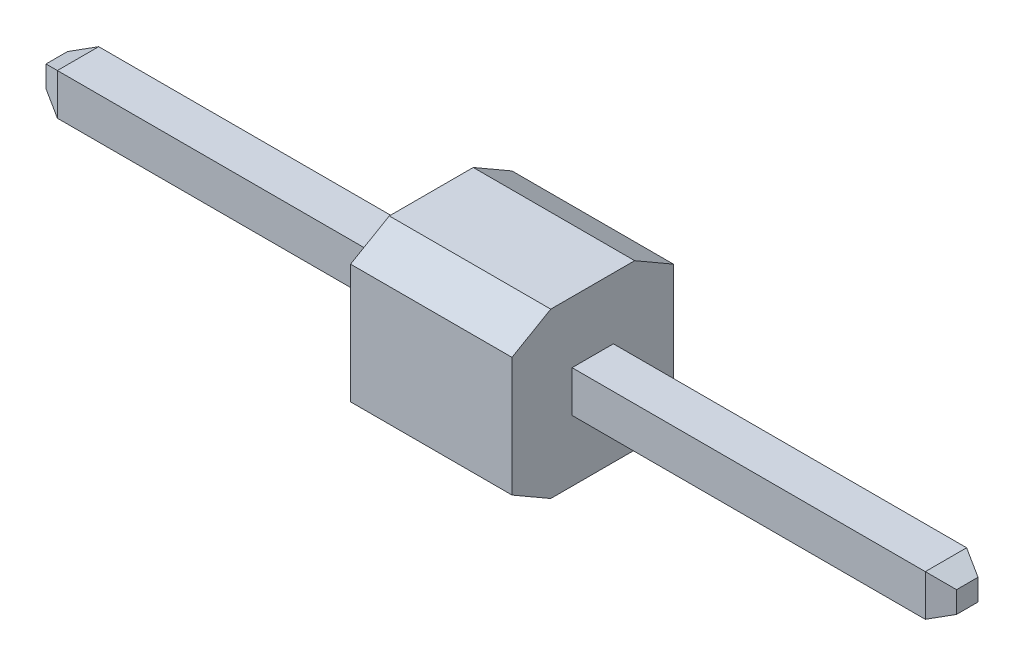
ISO-10303-21;
HEADER;
FILE_DESCRIPTION(('STEP AP214'),'2;1');
FILE_NAME('part.step','',(''),(''),'','','');
FILE_SCHEMA(('AUTOMOTIVE_DESIGN { 1 0 10303 214 1 1 1 1 }'));
ENDSEC;
DATA;
#1=APPLICATION_CONTEXT('core data for automotive mechanical design processes');
#2=APPLICATION_PROTOCOL_DEFINITION('international standard','automotive_design',2000,#1);
#3=PRODUCT_CONTEXT('',#1,'mechanical');
#4=PRODUCT('Part','Part','',(#3));
#5=PRODUCT_RELATED_PRODUCT_CATEGORY('part','',(#4));
#6=PRODUCT_DEFINITION_FORMATION('','',#4);
#7=PRODUCT_DEFINITION_CONTEXT('part definition',#1,'design');
#8=PRODUCT_DEFINITION('design','',#6,#7);
#9=PRODUCT_DEFINITION_SHAPE('','',#8);
#10=(LENGTH_UNIT() NAMED_UNIT(*) SI_UNIT(.MILLI.,.METRE.));
#11=(NAMED_UNIT(*) PLANE_ANGLE_UNIT() SI_UNIT($,.RADIAN.));
#12=(NAMED_UNIT(*) SI_UNIT($,.STERADIAN.) SOLID_ANGLE_UNIT());
#13=UNCERTAINTY_MEASURE_WITH_UNIT(LENGTH_MEASURE(1.E-05),#10,'distance_accuracy_value','');
#14=(GEOMETRIC_REPRESENTATION_CONTEXT(3) GLOBAL_UNCERTAINTY_ASSIGNED_CONTEXT((#13)) GLOBAL_UNIT_ASSIGNED_CONTEXT((#10,
#11,#12)) REPRESENTATION_CONTEXT('',''));
#15=CARTESIAN_POINT('',(0.,0.,0.));
#16=DIRECTION('',(0.,0.,1.));
#17=DIRECTION('',(1.,0.,0.));
#18=AXIS2_PLACEMENT_3D('',#15,#16,#17);
#19=CARTESIAN_POINT('',(5.42105085659442,0.317121448103038,-2.62999825440876));
#20=DIRECTION('',(1.,-9.93476518829084E-08,4.37113882867379E-08));
#21=DIRECTION('',(-9.93476589883358E-08,-1.,8.74227765734759E-08));
#22=AXIS2_PLACEMENT_3D('',#19,#20,#21);
#23=PLANE('',#22);
#24=DIRECTION('',(-1.18186632779335E-08,-0.50000007571054,-0.866025360072934));
#25=VECTOR('',#24,1.);
#26=CARTESIAN_POINT('',(5.42105066441981,-0.926468253133191,-1.05999814569068));
#27=LINE('',#26,#25);
#28=CARTESIAN_POINT('',(5.42105066441981,-0.926468253133191,-1.05999814569068));
#29=VERTEX_POINT('',#28);
#30=CARTESIAN_POINT('',(5.4210506562316,-1.27287846709686,-1.65999811540655));
#31=VERTEX_POINT('',#30);
#32=EDGE_CURVE('E11',#29,#31,#27,.T.);
#33=ORIENTED_EDGE('',*,*,#32,.T.);
#34=DIRECTION('',(4.37113811813104E-08,-8.74227828590458E-08,-0.999999999999995));
#35=VECTOR('',#34,1.);
#36=CARTESIAN_POINT('',(5.4210506562316,-1.27287846709686,-1.65999811540655));
#37=LINE('',#36,#35);
#38=CARTESIAN_POINT('',(5.4210507130564,-1.27287858074648,-2.95999811540655));
#39=VERTEX_POINT('',#38);
#40=EDGE_CURVE('E304',#31,#39,#37,.T.);
#41=ORIENTED_EDGE('',*,*,#40,.T.);
#42=DIRECTION('',(8.75289963531794E-08,0.499999924289837,-0.866025447495713));
#43=VECTOR('',#42,1.);
#44=CARTESIAN_POINT('',(5.4210507130564,-1.27287858074648,-2.95999811540655));
#45=LINE('',#44,#43);
#46=CARTESIAN_POINT('',(5.42105077369826,-0.92646847169015,-3.55999814569068));
#47=VERTEX_POINT('',#46);
#48=EDGE_CURVE('E296',#39,#47,#45,.T.);
#49=ORIENTED_EDGE('',*,*,#48,.T.);
#50=DIRECTION('',(9.93476588436478E-08,0.999999999999991,-8.74227767226935E-08));
#51=VECTOR('',#50,1.);
#52=CARTESIAN_POINT('',(5.42105077369826,-0.92646847169015,-3.55999814569068));
#53=LINE('',#52,#51);
#54=CARTESIAN_POINT('',(5.42105095721124,0.920711205279851,-3.55999830717626));
#55=VERTEX_POINT('',#54);
#56=EDGE_CURVE('E281',#47,#55,#53,.T.);
#57=ORIENTED_EDGE('',*,*,#56,.T.);
#58=DIRECTION('',(-1.18186632778483E-08,-0.500000075710537,-0.866025360072935));
#59=VECTOR('',#58,1.);
#60=CARTESIAN_POINT('',(5.42105096539945,1.26712141925352,-2.9599983374604));
#61=LINE('',#60,#59);
#62=CARTESIAN_POINT('',(5.42105096539945,1.26712141925352,-2.9599983374604));
#63=VERTEX_POINT('',#62);
#64=EDGE_CURVE('E265',#63,#55,#61,.T.);
#65=ORIENTED_EDGE('',*,*,#64,.F.);
#66=DIRECTION('',(4.37113811813104E-08,-8.74227828590458E-08,-0.999999999999995));
#67=VECTOR('',#66,1.);
#68=CARTESIAN_POINT('',(5.42105090857466,1.26712153290314,-1.6599983374604));
#69=LINE('',#68,#67);
#70=CARTESIAN_POINT('',(5.42105090857466,1.26712153290314,-1.6599983374604));
#71=VERTEX_POINT('',#70);
#72=EDGE_CURVE('E248',#71,#63,#69,.T.);
#73=ORIENTED_EDGE('',*,*,#72,.F.);
#74=DIRECTION('',(8.75289963525479E-08,0.499999924289836,-0.866025447495713));
#75=VECTOR('',#74,1.);
#76=CARTESIAN_POINT('',(5.42105084793279,0.92071142383681,-1.05999830717626));
#77=LINE('',#76,#75);
#78=CARTESIAN_POINT('',(5.42105084793279,0.92071142383681,-1.05999830717626));
#79=VERTEX_POINT('',#78);
#80=EDGE_CURVE('E242',#79,#71,#77,.T.);
#81=ORIENTED_EDGE('',*,*,#80,.F.);
#82=DIRECTION('',(9.93476588436478E-08,0.999999999999991,-8.7422776241864E-08));
#83=VECTOR('',#82,1.);
#84=CARTESIAN_POINT('',(5.42105066441981,-0.926468253133191,-1.05999814569068));
#85=LINE('',#84,#83);
#86=EDGE_CURVE('E236',#29,#79,#85,.T.);
#87=ORIENTED_EDGE('',*,*,#86,.F.);
#88=EDGE_LOOP('',(#33,#41,#49,#57,#65,#73,#81,#87));
#89=FACE_BOUND('',#88,.T.);
#90=DIRECTION('',(-4.37113803486431E-08,8.74227829017466E-08,0.999999999999995));
#91=VECTOR('',#90,1.);
#92=CARTESIAN_POINT('',(5.42105079301192,-0.322878551896961,-2.62999819845818));
#93=LINE('',#92,#91);
#94=CARTESIAN_POINT('',(5.42105079301192,-0.322878551896961,-2.62999819845818));
#95=VERTEX_POINT('',#94);
#96=CARTESIAN_POINT('',(5.42105076503663,-0.32287849594638,-1.98999819845818));
#97=VERTEX_POINT('',#96);
#98=EDGE_CURVE('E302',#95,#97,#93,.T.);
#99=ORIENTED_EDGE('',*,*,#98,.T.);
#100=DIRECTION('',(-9.93476578781121E-08,-0.999999999999991,8.7422776656742E-08));
#101=VECTOR('',#100,1.);
#102=CARTESIAN_POINT('',(5.42105082861914,0.317121504053619,-1.98999825440876));
#103=LINE('',#102,#101);
#104=CARTESIAN_POINT('',(5.42105082861914,0.317121504053619,-1.98999825440876));
#105=VERTEX_POINT('',#104);
#106=EDGE_CURVE('E293',#105,#97,#103,.T.);
#107=ORIENTED_EDGE('',*,*,#106,.F.);
#108=DIRECTION('',(-4.37113817364219E-08,8.74227829017467E-08,0.999999999999995));
#109=VECTOR('',#108,1.);
#110=CARTESIAN_POINT('',(5.42105085659442,0.317121448103038,-2.62999825440876));
#111=LINE('',#110,#109);
#112=CARTESIAN_POINT('',(5.42105085659442,0.317121448103038,-2.62999825440876));
#113=VERTEX_POINT('',#112);
#114=EDGE_CURVE('E278',#113,#105,#111,.T.);
#115=ORIENTED_EDGE('',*,*,#114,.F.);
#116=DIRECTION('',(-9.93476592658908E-08,-0.999999999999991,8.74227759628526E-08));
#117=VECTOR('',#116,1.);
#118=CARTESIAN_POINT('',(5.42105085659442,0.317121448103038,-2.62999825440876));
#119=LINE('',#118,#117);
#120=EDGE_CURVE('E263',#113,#95,#119,.T.);
#121=ORIENTED_EDGE('',*,*,#120,.T.);
#122=EDGE_LOOP('',(#99,#107,#115,#121));
#123=FACE_BOUND('',#122,.T.);
#124=ADVANCED_FACE('F17',(#89,#123),#23,.T.);
#125=CARTESIAN_POINT('',(2.92105085659442,0.317121696472167,-2.62999836368723));
#126=DIRECTION('',(1.,-9.93476518829084E-08,4.37113882867379E-08));
#127=DIRECTION('',(-9.93476589883358E-08,-1.,8.74227765734759E-08));
#128=AXIS2_PLACEMENT_3D('',#125,#126,#127);
#129=PLANE('',#128);
#130=DIRECTION('',(-1.1818662636946E-08,-0.50000007571054,-0.866025360072934));
#131=VECTOR('',#130,1.);
#132=CARTESIAN_POINT('',(2.92105066441981,-0.926468004764061,-1.05999825496915));
#133=LINE('',#132,#131);
#134=CARTESIAN_POINT('',(2.92105066441981,-0.926468004764061,-1.05999825496915));
#135=VERTEX_POINT('',#134);
#136=CARTESIAN_POINT('',(2.9210506562316,-1.27287821872773,-1.65999822468502));
#137=VERTEX_POINT('',#136);
#138=EDGE_CURVE('E24',#135,#137,#133,.T.);
#139=ORIENTED_EDGE('',*,*,#138,.F.);
#140=DIRECTION('',(9.93476590840625E-08,0.999999999999991,-8.7422776241864E-08));
#141=VECTOR('',#140,1.);
#142=CARTESIAN_POINT('',(2.92105066441981,-0.926468004764061,-1.05999825496915));
#143=LINE('',#142,#141);
#144=CARTESIAN_POINT('',(2.92105084793279,0.92071167220594,-1.05999841645473));
#145=VERTEX_POINT('',#144);
#146=EDGE_CURVE('E300',#135,#145,#143,.T.);
#147=ORIENTED_EDGE('',*,*,#146,.T.);
#148=DIRECTION('',(8.75289957115603E-08,0.499999924289836,-0.866025447495713));
#149=VECTOR('',#148,1.);
#150=CARTESIAN_POINT('',(2.92105084793279,0.92071167220594,-1.05999841645473));
#151=LINE('',#150,#149);
#152=CARTESIAN_POINT('',(2.92105090857466,1.26712178127227,-1.65999844673887));
#153=VERTEX_POINT('',#152);
#154=EDGE_CURVE('E286',#145,#153,#151,.T.);
#155=ORIENTED_EDGE('',*,*,#154,.T.);
#156=DIRECTION('',(4.37113811813104E-08,-8.74227828590458E-08,-0.999999999999995));
#157=VECTOR('',#156,1.);
#158=CARTESIAN_POINT('',(2.92105090857466,1.26712178127227,-1.65999844673887));
#159=LINE('',#158,#157);
#160=CARTESIAN_POINT('',(2.92105096539945,1.26712166762265,-2.95999844673887));
#161=VERTEX_POINT('',#160);
#162=EDGE_CURVE('E271',#153,#161,#159,.T.);
#163=ORIENTED_EDGE('',*,*,#162,.T.);
#164=DIRECTION('',(-1.18186626368607E-08,-0.500000075710537,-0.866025360072935));
#165=VECTOR('',#164,1.);
#166=CARTESIAN_POINT('',(2.92105096539945,1.26712166762265,-2.95999844673887));
#167=LINE('',#166,#165);
#168=CARTESIAN_POINT('',(2.92105095721124,0.92071145364898,-3.55999841645473));
#169=VERTEX_POINT('',#168);
#170=EDGE_CURVE('E253',#161,#169,#167,.T.);
#171=ORIENTED_EDGE('',*,*,#170,.T.);
#172=DIRECTION('',(9.93476590840625E-08,0.999999999999991,-8.74227767226935E-08));
#173=VECTOR('',#172,1.);
#174=CARTESIAN_POINT('',(2.92105077369826,-0.92646822332102,-3.55999825496915));
#175=LINE('',#174,#173);
#176=CARTESIAN_POINT('',(2.92105077369826,-0.92646822332102,-3.55999825496915));
#177=VERTEX_POINT('',#176);
#178=EDGE_CURVE('E261',#177,#169,#175,.T.);
#179=ORIENTED_EDGE('',*,*,#178,.F.);
#180=DIRECTION('',(8.75289957121919E-08,0.499999924289837,-0.866025447495713));
#181=VECTOR('',#180,1.);
#182=CARTESIAN_POINT('',(2.9210507130564,-1.27287833237735,-2.95999822468502));
#183=LINE('',#182,#181);
#184=CARTESIAN_POINT('',(2.9210507130564,-1.27287833237735,-2.95999822468502));
#185=VERTEX_POINT('',#184);
#186=EDGE_CURVE('E276',#185,#177,#183,.T.);
#187=ORIENTED_EDGE('',*,*,#186,.F.);
#188=DIRECTION('',(4.37113811813104E-08,-8.74227828590458E-08,-0.999999999999995));
#189=VECTOR('',#188,1.);
#190=CARTESIAN_POINT('',(2.9210506562316,-1.27287821872773,-1.65999822468502));
#191=LINE('',#190,#189);
#192=EDGE_CURVE('E291',#137,#185,#191,.T.);
#193=ORIENTED_EDGE('',*,*,#192,.F.);
#194=EDGE_LOOP('',(#139,#147,#155,#163,#171,#179,#187,#193));
#195=FACE_BOUND('',#194,.T.);
#196=DIRECTION('',(-9.93476592658908E-08,-0.999999999999991,8.7422776656742E-08));
#197=VECTOR('',#196,1.);
#198=CARTESIAN_POINT('',(2.92105082861914,0.317121752422748,-1.98999836368723));
#199=LINE('',#198,#197);
#200=CARTESIAN_POINT('',(2.92105082861914,0.317121752422748,-1.98999836368723));
#201=VERTEX_POINT('',#200);
#202=CARTESIAN_POINT('',(2.92105076503663,-0.32287824757725,-1.98999830773665));
#203=VERTEX_POINT('',#202);
#204=EDGE_CURVE('E298',#201,#203,#199,.T.);
#205=ORIENTED_EDGE('',*,*,#204,.T.);
#206=DIRECTION('',(-4.37113810425325E-08,8.74227829017466E-08,0.999999999999995));
#207=VECTOR('',#206,1.);
#208=CARTESIAN_POINT('',(2.92105079301192,-0.322878303527832,-2.62999830773665));
#209=LINE('',#208,#207);
#210=CARTESIAN_POINT('',(2.92105079301192,-0.322878303527832,-2.62999830773665));
#211=VERTEX_POINT('',#210);
#212=EDGE_CURVE('E283',#211,#203,#209,.T.);
#213=ORIENTED_EDGE('',*,*,#212,.F.);
#214=DIRECTION('',(-9.93476592658908E-08,-0.999999999999991,8.74227759628526E-08));
#215=VECTOR('',#214,1.);
#216=CARTESIAN_POINT('',(2.92105085659442,0.317121696472167,-2.62999836368723));
#217=LINE('',#216,#215);
#218=CARTESIAN_POINT('',(2.92105085659442,0.317121696472167,-2.62999836368723));
#219=VERTEX_POINT('',#218);
#220=EDGE_CURVE('E268',#219,#211,#217,.T.);
#221=ORIENTED_EDGE('',*,*,#220,.F.);
#222=DIRECTION('',(-4.37113810425325E-08,8.74227829017467E-08,0.999999999999995));
#223=VECTOR('',#222,1.);
#224=CARTESIAN_POINT('',(2.92105085659442,0.317121696472167,-2.62999836368723));
#225=LINE('',#224,#223);
#226=EDGE_CURVE('E251',#219,#201,#225,.T.);
#227=ORIENTED_EDGE('',*,*,#226,.T.);
#228=EDGE_LOOP('',(#205,#213,#221,#227));
#229=FACE_BOUND('',#228,.T.);
#230=ADVANCED_FACE('F314',(#195,#229),#129,.F.);
#231=CARTESIAN_POINT('',(5.42105066441981,-0.926468253133191,-1.05999814569068));
#232=DIRECTION('',(1.07893287081065E-07,0.866025360072937,-0.500000075710535));
#233=DIRECTION('',(1.18186629566715E-08,0.500000075710542,0.866025360072941));
#234=AXIS2_PLACEMENT_3D('',#231,#232,#233);
#235=PLANE('',#234);
#236=ORIENTED_EDGE('',*,*,#138,.T.);
#237=DIRECTION('',(-0.999999999999994,9.93476518829078E-08,-4.37113883755555E-08));
#238=VECTOR('',#237,1.);
#239=CARTESIAN_POINT('',(5.4210506562316,-1.27287846709686,-1.65999811540655));
#240=LINE('',#239,#238);
#241=EDGE_CURVE('E288',#31,#137,#240,.T.);
#242=ORIENTED_EDGE('',*,*,#241,.F.);
#243=ORIENTED_EDGE('',*,*,#32,.F.);
#244=DIRECTION('',(-0.999999999999994,9.93476518829078E-08,-4.3711388109102E-08));
#245=VECTOR('',#244,1.);
#246=CARTESIAN_POINT('',(5.42105066441981,-0.926468253133191,-1.05999814569068));
#247=LINE('',#246,#245);
#248=EDGE_CURVE('E256',#29,#135,#247,.T.);
#249=ORIENTED_EDGE('',*,*,#248,.T.);
#250=EDGE_LOOP('',(#236,#242,#243,#249));
#251=FACE_BOUND('',#250,.T.);
#252=ADVANCED_FACE('F306',(#251),#235,.F.);
#253=CARTESIAN_POINT('',(5.4210506562316,-1.27287846709686,-1.65999811540655));
#254=DIRECTION('',(9.93476589883358E-08,1.,-8.74227765734759E-08));
#255=DIRECTION('',(1.,-9.93476518829084E-08,4.37113882867379E-08));
#256=AXIS2_PLACEMENT_3D('',#253,#254,#255);
#257=PLANE('',#256);
#258=ORIENTED_EDGE('',*,*,#192,.T.);
#259=DIRECTION('',(-0.999999999999994,9.93476518829078E-08,-4.37113882867377E-08));
#260=VECTOR('',#259,1.);
#261=CARTESIAN_POINT('',(5.4210507130564,-1.27287858074648,-2.95999811540655));
#262=LINE('',#261,#260);
#263=EDGE_CURVE('E273',#39,#185,#262,.T.);
#264=ORIENTED_EDGE('',*,*,#263,.F.);
#265=ORIENTED_EDGE('',*,*,#40,.F.);
#266=ORIENTED_EDGE('',*,*,#241,.T.);
#267=EDGE_LOOP('',(#258,#264,#265,#266));
#268=FACE_BOUND('',#267,.T.);
#269=ADVANCED_FACE('F311',(#268),#257,.F.);
#270=CARTESIAN_POINT('',(5.4210507130564,-1.27287858074648,-2.95999811540655));
#271=DIRECTION('',(6.41819058997377E-08,0.866025447495721,0.499999924289845));
#272=DIRECTION('',(-8.7528996031702E-08,-0.499999924289838,0.866025447495717));
#273=AXIS2_PLACEMENT_3D('',#270,#271,#272);
#274=PLANE('',#273);
#275=ORIENTED_EDGE('',*,*,#186,.T.);
#276=DIRECTION('',(-0.999999999999994,9.93476518829078E-08,-4.37113884643734E-08));
#277=VECTOR('',#276,1.);
#278=CARTESIAN_POINT('',(5.42105077369826,-0.92646847169015,-3.55999814569068));
#279=LINE('',#278,#277);
#280=EDGE_CURVE('E258',#47,#177,#279,.T.);
#281=ORIENTED_EDGE('',*,*,#280,.F.);
#282=ORIENTED_EDGE('',*,*,#48,.F.);
#283=ORIENTED_EDGE('',*,*,#263,.T.);
#284=EDGE_LOOP('',(#275,#281,#282,#283));
#285=FACE_BOUND('',#284,.T.);
#286=ADVANCED_FACE('F319',(#285),#274,.F.);
#287=CARTESIAN_POINT('',(5.42105077369826,-0.92646847169015,-3.55999814569068));
#288=DIRECTION('',(-4.37113811813106E-08,8.74227836789032E-08,1.));
#289=DIRECTION('',(-1.,9.93476518829084E-08,-4.37113882867379E-08));
#290=AXIS2_PLACEMENT_3D('',#287,#288,#289);
#291=PLANE('',#290);
#292=ORIENTED_EDGE('',*,*,#178,.T.);
#293=DIRECTION('',(-0.999999999999994,9.93476533039933E-08,-4.37113882867377E-08));
#294=VECTOR('',#293,1.);
#295=CARTESIAN_POINT('',(5.42105095721124,0.920711205279851,-3.55999830717626));
#296=LINE('',#295,#294);
#297=EDGE_CURVE('E245',#55,#169,#296,.T.);
#298=ORIENTED_EDGE('',*,*,#297,.F.);
#299=ORIENTED_EDGE('',*,*,#56,.F.);
#300=ORIENTED_EDGE('',*,*,#280,.T.);
#301=EDGE_LOOP('',(#292,#298,#299,#300));
#302=FACE_BOUND('',#301,.T.);
#303=ADVANCED_FACE('F326',(#302),#291,.F.);
#304=CARTESIAN_POINT('',(5.42105096539945,1.26712141925352,-2.9599983374604));
#305=DIRECTION('',(1.07893287081065E-07,0.866025360072937,-0.500000075710535));
#306=DIRECTION('',(1.18186629566715E-08,0.500000075710542,0.866025360072941));
#307=AXIS2_PLACEMENT_3D('',#304,#305,#306);
#308=PLANE('',#307);
#309=ORIENTED_EDGE('',*,*,#170,.F.);
#310=DIRECTION('',(-0.999999999999994,9.93476511723651E-08,-4.37113882867377E-08));
#311=VECTOR('',#310,1.);
#312=CARTESIAN_POINT('',(5.42105096539945,1.26712141925352,-2.9599983374604));
#313=LINE('',#312,#311);
#314=EDGE_CURVE('E239',#63,#161,#313,.T.);
#315=ORIENTED_EDGE('',*,*,#314,.F.);
#316=ORIENTED_EDGE('',*,*,#64,.T.);
#317=ORIENTED_EDGE('',*,*,#297,.T.);
#318=EDGE_LOOP('',(#309,#315,#316,#317));
#319=FACE_BOUND('',#318,.T.);
#320=ADVANCED_FACE('F329',(#319),#308,.T.);
#321=CARTESIAN_POINT('',(5.42105090857466,1.26712153290314,-1.6599983374604));
#322=DIRECTION('',(9.93476589883358E-08,1.,-8.74227765734759E-08));
#323=DIRECTION('',(1.,-9.93476518829084E-08,4.37113882867379E-08));
#324=AXIS2_PLACEMENT_3D('',#321,#322,#323);
#325=PLANE('',#324);
#326=ORIENTED_EDGE('',*,*,#162,.F.);
#327=DIRECTION('',(-0.999999999999994,9.93476511723651E-08,-4.37113884643734E-08));
#328=VECTOR('',#327,1.);
#329=CARTESIAN_POINT('',(5.42105090857466,1.26712153290314,-1.6599983374604));
#330=LINE('',#329,#328);
#331=EDGE_CURVE('E233',#71,#153,#330,.T.);
#332=ORIENTED_EDGE('',*,*,#331,.F.);
#333=ORIENTED_EDGE('',*,*,#72,.T.);
#334=ORIENTED_EDGE('',*,*,#314,.T.);
#335=EDGE_LOOP('',(#326,#332,#333,#334));
#336=FACE_BOUND('',#335,.T.);
#337=ADVANCED_FACE('F333',(#336),#325,.T.);
#338=CARTESIAN_POINT('',(5.42105084793279,0.92071142383681,-1.05999830717626));
#339=DIRECTION('',(6.41819058997377E-08,0.866025447495721,0.499999924289845));
#340=DIRECTION('',(-8.7528996031702E-08,-0.499999924289838,0.866025447495717));
#341=AXIS2_PLACEMENT_3D('',#338,#339,#340);
#342=PLANE('',#341);
#343=ORIENTED_EDGE('',*,*,#154,.F.);
#344=DIRECTION('',(-0.999999999999994,9.93476533039933E-08,-4.3711388109102E-08));
#345=VECTOR('',#344,1.);
#346=CARTESIAN_POINT('',(5.42105084793279,0.92071142383681,-1.05999830717626));
#347=LINE('',#346,#345);
#348=EDGE_CURVE('E230',#79,#145,#347,.T.);
#349=ORIENTED_EDGE('',*,*,#348,.F.);
#350=ORIENTED_EDGE('',*,*,#80,.T.);
#351=ORIENTED_EDGE('',*,*,#331,.T.);
#352=EDGE_LOOP('',(#343,#349,#350,#351));
#353=FACE_BOUND('',#352,.T.);
#354=ADVANCED_FACE('F337',(#353),#342,.T.);
#355=CARTESIAN_POINT('',(5.42105066441981,-0.926468253133191,-1.05999814569068));
#356=DIRECTION('',(-4.37113811813106E-08,8.74227835615132E-08,1.));
#357=DIRECTION('',(-9.93476589883358E-08,-1.,8.74227764560859E-08));
#358=AXIS2_PLACEMENT_3D('',#355,#356,#357);
#359=PLANE('',#358);
#360=ORIENTED_EDGE('',*,*,#146,.F.);
#361=ORIENTED_EDGE('',*,*,#248,.F.);
#362=ORIENTED_EDGE('',*,*,#86,.T.);
#363=ORIENTED_EDGE('',*,*,#348,.T.);
#364=EDGE_LOOP('',(#360,#361,#362,#363));
#365=FACE_BOUND('',#364,.T.);
#366=ADVANCED_FACE('F339',(#365),#359,.T.);
#367=CARTESIAN_POINT('',(-2.87894914340558,0.317122272688549,-2.62999861721328));
#368=DIRECTION('',(-1.,9.93476518829084E-08,-4.37113882867379E-08));
#369=DIRECTION('',(9.93476589883358E-08,1.,-8.74227765734759E-08));
#370=AXIS2_PLACEMENT_3D('',#367,#368,#369);
#371=PLANE('',#370);
#372=DIRECTION('',(9.93476608211201E-08,0.999999999999991,-8.7422776141512E-08));
#373=VECTOR('',#372,1.);
#374=CARTESIAN_POINT('',(-2.87894921294922,-0.168996157623621,-2.14388010190646));
#375=LINE('',#374,#373);
#376=CARTESIAN_POINT('',(-2.87894921294922,-0.168996157623621,-2.14388010190646));
#377=VERTEX_POINT('',#376);
#378=CARTESIAN_POINT('',(-2.87894917994226,0.163240787986378,-2.14388013095153));
#379=VERTEX_POINT('',#378);
#380=EDGE_CURVE('E228',#377,#379,#375,.T.);
#381=ORIENTED_EDGE('',*,*,#380,.T.);
#382=DIRECTION('',(4.37113820547149E-08,-8.74227801493995E-08,-0.999999999999995));
#383=VECTOR('',#382,1.);
#384=CARTESIAN_POINT('',(-2.87894917994226,0.163240787986378,-2.14388013095153));
#385=LINE('',#384,#383);
#386=CARTESIAN_POINT('',(-2.87894916541972,0.163240758941301,-2.47611707656953));
#387=VERTEX_POINT('',#386);
#388=EDGE_CURVE('E223',#379,#387,#385,.T.);
#389=ORIENTED_EDGE('',*,*,#388,.T.);
#390=DIRECTION('',(-9.93476581477913E-08,-0.999999999999991,8.74227761415115E-08));
#391=VECTOR('',#390,1.);
#392=CARTESIAN_POINT('',(-2.87894916541972,0.163240758941303,-2.47611707656953));
#393=LINE('',#392,#391);
#394=CARTESIAN_POINT('',(-2.87894919842669,-0.168996186668698,-2.47611704752446));
#395=VERTEX_POINT('',#394);
#396=EDGE_CURVE('E215',#387,#395,#393,.T.);
#397=ORIENTED_EDGE('',*,*,#396,.T.);
#398=DIRECTION('',(-4.37113740347301E-08,8.7422774802743E-08,0.999999999999995));
#399=VECTOR('',#398,1.);
#400=CARTESIAN_POINT('',(-2.87894919842669,-0.168996186668698,-2.47611704752446));
#401=LINE('',#400,#399);
#402=EDGE_CURVE('E207',#395,#377,#401,.T.);
#403=ORIENTED_EDGE('',*,*,#402,.T.);
#404=EDGE_LOOP('',(#381,#389,#397,#403));
#405=FACE_BOUND('',#404,.T.);
#406=ADVANCED_FACE('F341',(#405),#371,.T.);
#407=CARTESIAN_POINT('',(-2.87894914340558,0.317122272688549,-2.62999861721328));
#408=DIRECTION('',(9.93476589883358E-08,1.,-8.74227764510112E-08));
#409=DIRECTION('',(-4.37113811813106E-08,8.74227835564385E-08,1.));
#410=AXIS2_PLACEMENT_3D('',#407,#408,#409);
#411=PLANE('',#410);
#412=DIRECTION('',(0.999999999999994,-9.93476511294987E-08,4.37113883581816E-08));
#413=VECTOR('',#412,1.);
#414=CARTESIAN_POINT('',(-2.54894914340558,0.317122239903822,-2.62999860278853));
#415=LINE('',#414,#413);
#416=CARTESIAN_POINT('',(-2.54894914340558,0.317122239903822,-2.62999860278853));
#417=VERTEX_POINT('',#416);
#418=EDGE_CURVE('E225',#417,#219,#415,.T.);
#419=ORIENTED_EDGE('',*,*,#418,.F.);
#420=DIRECTION('',(-4.37113817364219E-08,8.74227829017466E-08,0.999999999999995));
#421=VECTOR('',#420,1.);
#422=CARTESIAN_POINT('',(-2.54894914340558,0.317122239903822,-2.62999860278853));
#423=LINE('',#422,#421);
#424=CARTESIAN_POINT('',(-2.54894917138086,0.317122295854404,-1.98999860278853));
#425=VERTEX_POINT('',#424);
#426=EDGE_CURVE('E217',#417,#425,#423,.T.);
#427=ORIENTED_EDGE('',*,*,#426,.T.);
#428=DIRECTION('',(0.999999999999994,-9.93476511294987E-08,4.37113882364021E-08));
#429=VECTOR('',#428,1.);
#430=CARTESIAN_POINT('',(-2.54894917138086,0.317122295854404,-1.98999860278853));
#431=LINE('',#430,#429);
#432=EDGE_CURVE('E220',#425,#201,#431,.T.);
#433=ORIENTED_EDGE('',*,*,#432,.T.);
#434=ORIENTED_EDGE('',*,*,#226,.F.);
#435=EDGE_LOOP('',(#419,#427,#433,#434));
#436=FACE_BOUND('',#435,.T.);
#437=ADVANCED_FACE('F348',(#436),#411,.T.);
#438=CARTESIAN_POINT('',(-2.87894917138086,0.31712232863913,-1.98999861721328));
#439=DIRECTION('',(-4.37113811813106E-08,8.74227836789032E-08,1.));
#440=DIRECTION('',(-1.,9.93476518829084E-08,-4.37113882867379E-08));
#441=AXIS2_PLACEMENT_3D('',#438,#439,#440);
#442=PLANE('',#441);
#443=ORIENTED_EDGE('',*,*,#432,.F.);
#444=DIRECTION('',(-9.93476578781121E-08,-0.999999999999991,8.7422776656742E-08));
#445=VECTOR('',#444,1.);
#446=CARTESIAN_POINT('',(-2.54894917138086,0.317122295854404,-1.98999860278853));
#447=LINE('',#446,#445);
#448=CARTESIAN_POINT('',(-2.54894923496337,-0.322877704145595,-1.98999854683795));
#449=VERTEX_POINT('',#448);
#450=EDGE_CURVE('E209',#425,#449,#447,.T.);
#451=ORIENTED_EDGE('',*,*,#450,.T.);
#452=DIRECTION('',(0.999999999999994,-9.93476501552628E-08,4.37113882364022E-08));
#453=VECTOR('',#452,1.);
#454=CARTESIAN_POINT('',(-2.54894923496337,-0.322877704145595,-1.98999854683795));
#455=LINE('',#454,#453);
#456=EDGE_CURVE('E212',#449,#203,#455,.T.);
#457=ORIENTED_EDGE('',*,*,#456,.T.);
#458=ORIENTED_EDGE('',*,*,#204,.F.);
#459=EDGE_LOOP('',(#443,#451,#457,#458));
#460=FACE_BOUND('',#459,.T.);
#461=ADVANCED_FACE('F424',(#460),#442,.T.);
#462=CARTESIAN_POINT('',(-2.87894920698808,-0.32287772731145,-2.62999856126271));
#463=DIRECTION('',(9.93476589883357E-08,1.,-8.74227764040693E-08));
#464=DIRECTION('',(-4.37113811813106E-08,8.74227835094966E-08,1.));
#465=AXIS2_PLACEMENT_3D('',#462,#463,#464);
#466=PLANE('',#465);
#467=ORIENTED_EDGE('',*,*,#456,.F.);
#468=DIRECTION('',(4.37113817364219E-08,-8.74227829017466E-08,-0.999999999999995));
#469=VECTOR('',#468,1.);
#470=CARTESIAN_POINT('',(-2.54894923496337,-0.322877704145595,-1.98999854683795));
#471=LINE('',#470,#469);
#472=CARTESIAN_POINT('',(-2.54894920698808,-0.322877760096176,-2.62999854683795));
#473=VERTEX_POINT('',#472);
#474=EDGE_CURVE('E201',#449,#473,#471,.T.);
#475=ORIENTED_EDGE('',*,*,#474,.T.);
#476=DIRECTION('',(0.999999999999994,-9.93476501552628E-08,4.37113882769953E-08));
#477=VECTOR('',#476,1.);
#478=CARTESIAN_POINT('',(-2.54894920698808,-0.322877760096176,-2.62999854683795));
#479=LINE('',#478,#477);
#480=EDGE_CURVE('E204',#473,#211,#479,.T.);
#481=ORIENTED_EDGE('',*,*,#480,.T.);
#482=ORIENTED_EDGE('',*,*,#212,.T.);
#483=EDGE_LOOP('',(#467,#475,#481,#482));
#484=FACE_BOUND('',#483,.T.);
#485=ADVANCED_FACE('F421',(#484),#466,.F.);
#486=CARTESIAN_POINT('',(-2.87894914340558,0.317122272688549,-2.62999861721328));
#487=DIRECTION('',(-4.37113811813106E-08,8.74227836789032E-08,1.));
#488=DIRECTION('',(-1.,9.93476518829084E-08,-4.37113882867379E-08));
#489=AXIS2_PLACEMENT_3D('',#486,#487,#488);
#490=PLANE('',#489);
#491=ORIENTED_EDGE('',*,*,#480,.F.);
#492=DIRECTION('',(9.93476606536699E-08,0.999999999999991,-8.74227766567422E-08));
#493=VECTOR('',#492,1.);
#494=CARTESIAN_POINT('',(-2.54894920698808,-0.322877760096175,-2.62999854683795));
#495=LINE('',#494,#493);
#496=EDGE_CURVE('E196',#473,#417,#495,.T.);
#497=ORIENTED_EDGE('',*,*,#496,.T.);
#498=ORIENTED_EDGE('',*,*,#418,.T.);
#499=ORIENTED_EDGE('',*,*,#220,.T.);
#500=EDGE_LOOP('',(#491,#497,#498,#499));
#501=FACE_BOUND('',#500,.T.);
#502=ADVANCED_FACE('F376',(#501),#490,.F.);
#503=CARTESIAN_POINT('',(-2.87894914340558,0.317122272688549,-2.62999861721328));
#504=DIRECTION('',(-4.37113811813106E-08,8.74227836789032E-08,1.));
#505=DIRECTION('',(-1.,9.93476518829084E-08,-4.37113882867379E-08));
#506=AXIS2_PLACEMENT_3D('',#503,#504,#505);
#507=PLANE('',#506);
#508=DIRECTION('',(0.999999999999994,-9.93476465830644E-08,4.37113882769953E-08));
#509=VECTOR('',#508,1.);
#510=CARTESIAN_POINT('',(5.42105085659442,0.317121448103027,-2.62999825440876));
#511=LINE('',#510,#509);
#512=CARTESIAN_POINT('',(10.8910508565944,0.317120904671382,-2.62999801530747));
#513=VERTEX_POINT('',#512);
#514=EDGE_CURVE('E199',#113,#513,#511,.T.);
#515=ORIENTED_EDGE('',*,*,#514,.T.);
#516=DIRECTION('',(-9.93476578781121E-08,-0.999999999999991,8.7422776656742E-08));
#517=VECTOR('',#516,1.);
#518=CARTESIAN_POINT('',(10.8910508565944,0.317120904671382,-2.62999801530747));
#519=LINE('',#518,#517);
#520=CARTESIAN_POINT('',(10.8910507930119,-0.322879095328616,-2.62999795935689));
#521=VERTEX_POINT('',#520);
#522=EDGE_CURVE('E191',#513,#521,#519,.T.);
#523=ORIENTED_EDGE('',*,*,#522,.T.);
#524=DIRECTION('',(0.999999999999994,-9.93476517789893E-08,4.37113883581816E-08));
#525=VECTOR('',#524,1.);
#526=CARTESIAN_POINT('',(5.42105079301192,-0.322878551896959,-2.62999819845818));
#527=LINE('',#526,#525);
#528=EDGE_CURVE('E194',#95,#521,#527,.T.);
#529=ORIENTED_EDGE('',*,*,#528,.F.);
#530=ORIENTED_EDGE('',*,*,#120,.F.);
#531=EDGE_LOOP('',(#515,#523,#529,#530));
#532=FACE_BOUND('',#531,.T.);
#533=ADVANCED_FACE('F367',(#532),#507,.F.);
#534=CARTESIAN_POINT('',(-2.87894920698808,-0.32287772731145,-2.62999856126271));
#535=DIRECTION('',(9.93476589883357E-08,1.,-8.74227764040693E-08));
#536=DIRECTION('',(-4.37113811813106E-08,8.74227835094966E-08,1.));
#537=AXIS2_PLACEMENT_3D('',#534,#535,#536);
#538=PLANE('',#537);
#539=ORIENTED_EDGE('',*,*,#528,.T.);
#540=DIRECTION('',(-4.37113817364219E-08,8.74227829017467E-08,0.999999999999995));
#541=VECTOR('',#540,1.);
#542=CARTESIAN_POINT('',(10.8910507930119,-0.322879095328616,-2.62999795935689));
#543=LINE('',#542,#541);
#544=CARTESIAN_POINT('',(10.8910507650366,-0.322879039378035,-1.98999795935689));
#545=VERTEX_POINT('',#544);
#546=EDGE_CURVE('E186',#521,#545,#543,.T.);
#547=ORIENTED_EDGE('',*,*,#546,.T.);
#548=DIRECTION('',(0.999999999999994,-9.93476517789893E-08,4.37113881146227E-08));
#549=VECTOR('',#548,1.);
#550=CARTESIAN_POINT('',(5.42105076503663,-0.322878495946378,-1.98999819845818));
#551=LINE('',#550,#549);
#552=EDGE_CURVE('E189',#97,#545,#551,.T.);
#553=ORIENTED_EDGE('',*,*,#552,.F.);
#554=ORIENTED_EDGE('',*,*,#98,.F.);
#555=EDGE_LOOP('',(#539,#547,#553,#554));
#556=FACE_BOUND('',#555,.T.);
#557=ADVANCED_FACE('F364',(#556),#538,.F.);
#558=CARTESIAN_POINT('',(-2.87894917138086,0.31712232863913,-1.98999861721328));
#559=DIRECTION('',(-4.37113811813106E-08,8.74227836789032E-08,1.));
#560=DIRECTION('',(-1.,9.93476518829084E-08,-4.37113882867379E-08));
#561=AXIS2_PLACEMENT_3D('',#558,#559,#560);
#562=PLANE('',#561);
#563=ORIENTED_EDGE('',*,*,#552,.T.);
#564=DIRECTION('',(9.93476578781123E-08,0.999999999999991,-8.74227766567422E-08));
#565=VECTOR('',#564,1.);
#566=CARTESIAN_POINT('',(10.8910507650366,-0.322879039378034,-1.98999795935689));
#567=LINE('',#566,#565);
#568=CARTESIAN_POINT('',(10.8910508286191,0.317120960621963,-1.98999801530747));
#569=VERTEX_POINT('',#568);
#570=EDGE_CURVE('E176',#545,#569,#567,.T.);
#571=ORIENTED_EDGE('',*,*,#570,.T.);
#572=DIRECTION('',(0.999999999999994,-9.93476465830644E-08,4.37113881146227E-08));
#573=VECTOR('',#572,1.);
#574=CARTESIAN_POINT('',(5.42105082861914,0.317121504053608,-1.98999825440876));
#575=LINE('',#574,#573);
#576=EDGE_CURVE('E179',#105,#569,#575,.T.);
#577=ORIENTED_EDGE('',*,*,#576,.F.);
#578=ORIENTED_EDGE('',*,*,#106,.T.);
#579=EDGE_LOOP('',(#563,#571,#577,#578));
#580=FACE_BOUND('',#579,.T.);
#581=ADVANCED_FACE('F366',(#580),#562,.T.);
#582=CARTESIAN_POINT('',(-2.87894914340558,0.317122272688549,-2.62999861721328));
#583=DIRECTION('',(9.93476589883358E-08,1.,-8.74227764510112E-08));
#584=DIRECTION('',(-4.37113811813106E-08,8.74227835564385E-08,1.));
#585=AXIS2_PLACEMENT_3D('',#582,#583,#584);
#586=PLANE('',#585);
#587=ORIENTED_EDGE('',*,*,#576,.T.);
#588=DIRECTION('',(4.37113789608643E-08,-8.74227829017467E-08,-0.999999999999995));
#589=VECTOR('',#588,1.);
#590=CARTESIAN_POINT('',(10.8910508286191,0.317120960621963,-1.98999801530747));
#591=LINE('',#590,#589);
#592=EDGE_CURVE('E167',#569,#513,#591,.T.);
#593=ORIENTED_EDGE('',*,*,#592,.T.);
#594=ORIENTED_EDGE('',*,*,#514,.F.);
#595=ORIENTED_EDGE('',*,*,#114,.T.);
#596=EDGE_LOOP('',(#587,#593,#594,#595));
#597=FACE_BOUND('',#596,.T.);
#598=ADVANCED_FACE('F373',(#597),#586,.T.);
#599=CARTESIAN_POINT('',(11.2210508565944,0.317120871886656,-2.62999800088271));
#600=DIRECTION('',(-1.,9.93476518829084E-08,-4.37113882867379E-08));
#601=DIRECTION('',(9.93476589883358E-08,1.,-8.74227765734759E-08));
#602=AXIS2_PLACEMENT_3D('',#599,#600,#601);
#603=PLANE('',#602);
#604=DIRECTION('',(-9.93476581477913E-08,-0.999999999999991,8.74227761415115E-08));
#605=VECTOR('',#604,1.);
#606=CARTESIAN_POINT('',(11.2210508200577,0.163239387184488,-2.14387951462096));
#607=LINE('',#606,#605);
#608=CARTESIAN_POINT('',(11.2210508200577,0.163239387184486,-2.14387951462096));
#609=VERTEX_POINT('',#608);
#610=CARTESIAN_POINT('',(11.2210507870508,-0.168997558425513,-2.14387948557588));
#611=VERTEX_POINT('',#610);
#612=EDGE_CURVE('E153',#609,#611,#607,.T.);
#613=ORIENTED_EDGE('',*,*,#612,.T.);
#614=DIRECTION('',(4.37113820547149E-08,-8.74227801493995E-08,-0.999999999999995));
#615=VECTOR('',#614,1.);
#616=CARTESIAN_POINT('',(11.2210507870508,-0.168997558425513,-2.14387948557588));
#617=LINE('',#616,#615);
#618=CARTESIAN_POINT('',(11.2210508015733,-0.16899758747059,-2.47611643119388));
#619=VERTEX_POINT('',#618);
#620=EDGE_CURVE('E395',#611,#619,#617,.T.);
#621=ORIENTED_EDGE('',*,*,#620,.T.);
#622=DIRECTION('',(9.93476581477919E-08,0.999999999999991,-8.74227774781761E-08));
#623=VECTOR('',#622,1.);
#624=CARTESIAN_POINT('',(11.2210508015733,-0.16899758747059,-2.47611643119388));
#625=LINE('',#624,#623);
#626=CARTESIAN_POINT('',(11.2210508345803,0.163239358139409,-2.47611646023896));
#627=VERTEX_POINT('',#626);
#628=EDGE_CURVE('E156',#619,#627,#625,.T.);
#629=ORIENTED_EDGE('',*,*,#628,.T.);
#630=DIRECTION('',(-4.37113874013715E-08,8.7422774802743E-08,0.999999999999995));
#631=VECTOR('',#630,1.);
#632=CARTESIAN_POINT('',(11.2210508345803,0.163239358139409,-2.47611646023896));
#633=LINE('',#632,#631);
#634=EDGE_CURVE('E149',#627,#609,#633,.T.);
#635=ORIENTED_EDGE('',*,*,#634,.T.);
#636=EDGE_LOOP('',(#613,#621,#629,#635));
#637=FACE_BOUND('',#636,.T.);
#638=ADVANCED_FACE('F151',(#637),#603,.F.);
#639=CARTESIAN_POINT('',(-2.87894919170031,-0.16899620012145,-2.62999857471546));
#640=DIRECTION('',(-0.422618351780369,-0.906307745050466,6.07587120833484E-08));
#641=DIRECTION('',(4.37113811813106E-08,-8.74227835094966E-08,-1.));
#642=AXIS2_PLACEMENT_3D('',#639,#640,#641);
#643=PLANE('',#642);
#644=DIRECTION('',(0.83481707378875,-0.38928166954004,0.389281691158097));
#645=VECTOR('',#644,1.);
#646=CARTESIAN_POINT('',(-2.87894921294924,-0.168996157624139,-2.14388010190694));
#647=LINE('',#646,#645);
#648=EDGE_CURVE('E181',#377,#449,#647,.T.);
#649=ORIENTED_EDGE('',*,*,#648,.F.);
#650=ORIENTED_EDGE('',*,*,#402,.F.);
#651=DIRECTION('',(-0.834817107820821,0.389281737604208,0.389281550111906));
#652=VECTOR('',#651,1.);
#653=CARTESIAN_POINT('',(-2.54894920698851,-0.322877760097638,-2.62999854683741));
#654=LINE('',#653,#652);
#655=EDGE_CURVE('E404',#473,#395,#654,.T.);
#656=ORIENTED_EDGE('',*,*,#655,.F.);
#657=ORIENTED_EDGE('',*,*,#474,.F.);
#658=EDGE_LOOP('',(#649,#650,#656,#657));
#659=FACE_BOUND('',#658,.T.);
#660=ADVANCED_FACE('F418',(#659),#643,.T.);
#661=CARTESIAN_POINT('',(-2.87894915013195,0.3171222861413,-2.47611709002228));
#662=DIRECTION('',(-0.422618222124847,-3.72458176658199E-08,-0.906307805509828));
#663=DIRECTION('',(9.93476589883358E-08,1.,-8.74227765734759E-08));
#664=AXIS2_PLACEMENT_3D('',#661,#662,#663);
#665=PLANE('',#664);
#666=ORIENTED_EDGE('',*,*,#655,.T.);
#667=ORIENTED_EDGE('',*,*,#396,.F.);
#668=DIRECTION('',(-0.834817185169257,-0.389281503665795,0.389281618176065));
#669=VECTOR('',#668,1.);
#670=CARTESIAN_POINT('',(-2.54894914340443,0.317122239901096,-2.6299986027888));
#671=LINE('',#670,#669);
#672=EDGE_CURVE('E160',#417,#387,#671,.T.);
#673=ORIENTED_EDGE('',*,*,#672,.F.);
#674=ORIENTED_EDGE('',*,*,#496,.F.);
#675=EDGE_LOOP('',(#666,#667,#673,#674));
#676=FACE_BOUND('',#675,.T.);
#677=ADVANCED_FACE('F434',(#676),#665,.T.);
#678=CARTESIAN_POINT('',(-2.54894917138086,0.317122295854404,-1.98999860278853));
#679=DIRECTION('',(0.422618301356777,-1.21218081559392E-07,-0.906307768563367));
#680=DIRECTION('',(-9.93476589883358E-08,-1.,8.74227765734759E-08));
#681=AXIS2_PLACEMENT_3D('',#678,#679,#680);
#682=PLANE('',#681);
#683=ORIENTED_EDGE('',*,*,#648,.T.);
#684=ORIENTED_EDGE('',*,*,#450,.F.);
#685=DIRECTION('',(0.834817151137182,0.389281571729963,0.389281623093935));
#686=VECTOR('',#685,1.);
#687=CARTESIAN_POINT('',(-2.8789491799451,0.163240787993917,-2.14388013095299));
#688=LINE('',#687,#686);
#689=EDGE_CURVE('E170',#379,#425,#688,.T.);
#690=ORIENTED_EDGE('',*,*,#689,.F.);
#691=ORIENTED_EDGE('',*,*,#380,.F.);
#692=EDGE_LOOP('',(#683,#684,#690,#691));
#693=FACE_BOUND('',#692,.T.);
#694=ADVANCED_FACE('F413',(#693),#682,.F.);
#695=CARTESIAN_POINT('',(-2.54894914340558,0.317122239903822,-2.62999860278853));
#696=DIRECTION('',(0.422618171701255,-0.906307829022729,9.770517399793E-08));
#697=DIRECTION('',(-4.37113811813106E-08,8.74227835564385E-08,1.));
#698=AXIS2_PLACEMENT_3D('',#695,#696,#697);
#699=PLANE('',#698);
#700=ORIENTED_EDGE('',*,*,#672,.T.);
#701=ORIENTED_EDGE('',*,*,#388,.F.);
#702=ORIENTED_EDGE('',*,*,#689,.T.);
#703=ORIENTED_EDGE('',*,*,#426,.F.);
#704=EDGE_LOOP('',(#700,#701,#702,#703));
#705=FACE_BOUND('',#704,.T.);
#706=ADVANCED_FACE('F429',(#705),#699,.F.);
#707=CARTESIAN_POINT('',(11.2210508413067,0.163239344686657,-2.62999798742996));
#708=DIRECTION('',(0.422618351780369,0.906307745050466,-6.07587121258922E-08));
#709=DIRECTION('',(4.37113811813106E-08,-8.74227835564385E-08,-1.));
#710=AXIS2_PLACEMENT_3D('',#707,#708,#709);
#711=PLANE('',#710);
#712=DIRECTION('',(-0.834817107820822,0.389281737604207,0.389281550111905));
#713=VECTOR('',#712,1.);
#714=CARTESIAN_POINT('',(11.2210508200578,0.163239387185005,-2.14387951462144));
#715=LINE('',#714,#713);
#716=EDGE_CURVE('E164',#609,#569,#715,.T.);
#717=ORIENTED_EDGE('',*,*,#716,.F.);
#718=ORIENTED_EDGE('',*,*,#634,.F.);
#719=DIRECTION('',(0.834817073788749,-0.389281669540042,0.389281691158097));
#720=VECTOR('',#719,1.);
#721=CARTESIAN_POINT('',(10.8910508565944,0.317120904671382,-2.62999801530747));
#722=LINE('',#721,#720);
#723=EDGE_CURVE('E392',#513,#627,#722,.T.);
#724=ORIENTED_EDGE('',*,*,#723,.F.);
#725=ORIENTED_EDGE('',*,*,#592,.F.);
#726=EDGE_LOOP('',(#717,#718,#724,#725));
#727=FACE_BOUND('',#726,.T.);
#728=ADVANCED_FACE('F165',(#727),#711,.T.);
#729=CARTESIAN_POINT('',(10.8910508565944,0.317120904671382,-2.62999801530747));
#730=DIRECTION('',(-0.422618301356777,1.21218081559392E-07,0.906307768563367));
#731=DIRECTION('',(-9.93476589883358E-08,-1.,8.74227765734759E-08));
#732=AXIS2_PLACEMENT_3D('',#729,#730,#731);
#733=PLANE('',#732);
#734=ORIENTED_EDGE('',*,*,#723,.T.);
#735=ORIENTED_EDGE('',*,*,#628,.F.);
#736=DIRECTION('',(0.834817151137185,0.389281571729958,0.389281623093936));
#737=VECTOR('',#736,1.);
#738=CARTESIAN_POINT('',(10.8910507930135,-0.322879095332825,-2.62999795935599));
#739=LINE('',#738,#737);
#740=EDGE_CURVE('E389',#521,#619,#739,.T.);
#741=ORIENTED_EDGE('',*,*,#740,.F.);
#742=ORIENTED_EDGE('',*,*,#522,.F.);
#743=EDGE_LOOP('',(#734,#735,#741,#742));
#744=FACE_BOUND('',#743,.T.);
#745=ADVANCED_FACE('F390',(#744),#733,.F.);
#746=CARTESIAN_POINT('',(11.2210508353455,0.317120914384486,-2.14387952807371));
#747=DIRECTION('',(0.422618222124847,3.72458176658199E-08,0.906307805509828));
#748=DIRECTION('',(9.93476589883358E-08,1.,-8.74227765734759E-08));
#749=AXIS2_PLACEMENT_3D('',#746,#747,#748);
#750=PLANE('',#749);
#751=ORIENTED_EDGE('',*,*,#716,.T.);
#752=ORIENTED_EDGE('',*,*,#570,.F.);
#753=DIRECTION('',(-0.834817185169257,-0.389281503665796,0.389281618176065));
#754=VECTOR('',#753,1.);
#755=CARTESIAN_POINT('',(11.2210507870508,-0.16899755842603,-2.14387948557636));
#756=LINE('',#755,#754);
#757=EDGE_CURVE('E175',#611,#545,#756,.T.);
#758=ORIENTED_EDGE('',*,*,#757,.F.);
#759=ORIENTED_EDGE('',*,*,#612,.F.);
#760=EDGE_LOOP('',(#751,#752,#758,#759));
#761=FACE_BOUND('',#760,.T.);
#762=ADVANCED_FACE('F173',(#761),#750,.T.);
#763=CARTESIAN_POINT('',(10.8910507930119,-0.322879095328616,-2.62999795935689));
#764=DIRECTION('',(-0.422618171701255,0.906307829022729,-9.77051739553862E-08));
#765=DIRECTION('',(-4.37113811813106E-08,8.74227835094966E-08,1.));
#766=AXIS2_PLACEMENT_3D('',#763,#764,#765);
#767=PLANE('',#766);
#768=ORIENTED_EDGE('',*,*,#740,.T.);
#769=ORIENTED_EDGE('',*,*,#620,.F.);
#770=ORIENTED_EDGE('',*,*,#757,.T.);
#771=ORIENTED_EDGE('',*,*,#546,.F.);
#772=EDGE_LOOP('',(#768,#769,#770,#771));
#773=FACE_BOUND('',#772,.T.);
#774=ADVANCED_FACE('F394',(#773),#767,.F.);
#775=CLOSED_SHELL('',(#124,#230,#252,#269,#286,#303,#320,#337,#354,#366,#406,#437,#461,#485,
#502,#533,#557,#581,#598,#638,#660,#677,#694,#706,#728,#745,#762,#774));
#776=MANIFOLD_SOLID_BREP('B1',#775);
#777=ADVANCED_BREP_SHAPE_REPRESENTATION('',(#18,#776),#14);
#778=SHAPE_DEFINITION_REPRESENTATION(#9,#777);
ENDSEC;
END-ISO-10303-21;
